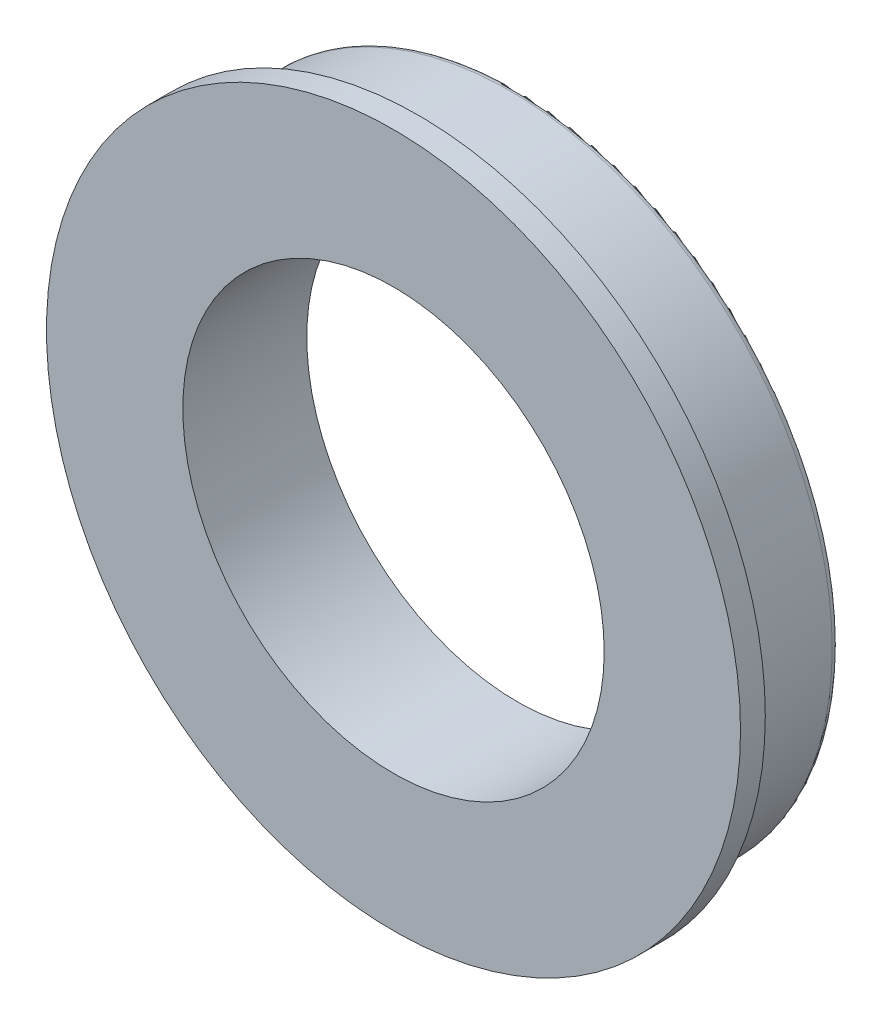
ISO-10303-21;
HEADER;
FILE_DESCRIPTION(('STEP AP214'),'2;1');
FILE_NAME('part.step','',(''),(''),'','','');
FILE_SCHEMA(('AUTOMOTIVE_DESIGN { 1 0 10303 214 1 1 1 1 }'));
ENDSEC;
DATA;
#1=APPLICATION_CONTEXT('core data for automotive mechanical design processes');
#2=APPLICATION_PROTOCOL_DEFINITION('international standard','automotive_design',2000,#1);
#3=PRODUCT_CONTEXT('',#1,'mechanical');
#4=PRODUCT('Part','Part','',(#3));
#5=PRODUCT_RELATED_PRODUCT_CATEGORY('part','',(#4));
#6=PRODUCT_DEFINITION_FORMATION('','',#4);
#7=PRODUCT_DEFINITION_CONTEXT('part definition',#1,'design');
#8=PRODUCT_DEFINITION('design','',#6,#7);
#9=PRODUCT_DEFINITION_SHAPE('','',#8);
#10=(LENGTH_UNIT() NAMED_UNIT(*) SI_UNIT(.MILLI.,.METRE.));
#11=(NAMED_UNIT(*) PLANE_ANGLE_UNIT() SI_UNIT($,.RADIAN.));
#12=(NAMED_UNIT(*) SI_UNIT($,.STERADIAN.) SOLID_ANGLE_UNIT());
#13=UNCERTAINTY_MEASURE_WITH_UNIT(LENGTH_MEASURE(1.E-05),#10,'distance_accuracy_value','');
#14=(GEOMETRIC_REPRESENTATION_CONTEXT(3) GLOBAL_UNCERTAINTY_ASSIGNED_CONTEXT((#13)) GLOBAL_UNIT_ASSIGNED_CONTEXT((#10,
#11,#12)) REPRESENTATION_CONTEXT('',''));
#15=CARTESIAN_POINT('',(0.,0.,0.));
#16=DIRECTION('',(0.,0.,1.));
#17=DIRECTION('',(1.,0.,0.));
#18=AXIS2_PLACEMENT_3D('',#15,#16,#17);
#19=CARTESIAN_POINT('',(0.,0.,5.));
#20=DIRECTION('',(0.,0.,-1.));
#21=DIRECTION('',(-1.,0.,0.));
#22=AXIS2_PLACEMENT_3D('',#19,#20,#21);
#23=CYLINDRICAL_SURFACE('',#22,13.);
#24=CARTESIAN_POINT('',(0.,0.,0.3));
#25=DIRECTION('',(0.,0.,1.));
#26=DIRECTION('',(1.,0.,0.));
#27=AXIS2_PLACEMENT_3D('',#24,#25,#26);
#28=CIRCLE('',#27,13.);
#29=CARTESIAN_POINT('',(13.,0.,0.3));
#30=VERTEX_POINT('',#29);
#31=EDGE_CURVE('E39',#30,#30,#28,.T.);
#32=ORIENTED_EDGE('',*,*,#31,.T.);
#33=EDGE_LOOP('',(#32));
#34=FACE_BOUND('',#33,.T.);
#35=CARTESIAN_POINT('',(0.,0.,4.));
#36=DIRECTION('',(0.,0.,1.));
#37=DIRECTION('',(1.,0.,0.));
#38=AXIS2_PLACEMENT_3D('',#35,#36,#37);
#39=CIRCLE('',#38,13.);
#40=CARTESIAN_POINT('',(13.,0.,4.));
#41=VERTEX_POINT('',#40);
#42=EDGE_CURVE('E43',#41,#41,#39,.T.);
#43=ORIENTED_EDGE('',*,*,#42,.F.);
#44=EDGE_LOOP('',(#43));
#45=FACE_BOUND('',#44,.T.);
#46=ADVANCED_FACE('F32',(#34,#45),#23,.T.);
#47=CARTESIAN_POINT('',(0.,0.,5.));
#48=DIRECTION('',(0.,0.,1.));
#49=DIRECTION('',(1.,0.,0.));
#50=AXIS2_PLACEMENT_3D('',#47,#48,#49);
#51=PLANE('',#50);
#52=CARTESIAN_POINT('',(0.,0.,5.));
#53=DIRECTION('',(0.,0.,1.));
#54=DIRECTION('',(1.,0.,0.));
#55=AXIS2_PLACEMENT_3D('',#52,#53,#54);
#56=CIRCLE('',#55,8.5);
#57=CARTESIAN_POINT('',(8.5,0.,5.));
#58=VERTEX_POINT('',#57);
#59=EDGE_CURVE('E47',#58,#58,#56,.T.);
#60=ORIENTED_EDGE('',*,*,#59,.F.);
#61=EDGE_LOOP('',(#60));
#62=FACE_BOUND('',#61,.T.);
#63=CARTESIAN_POINT('',(0.,0.,5.));
#64=DIRECTION('',(0.,0.,1.));
#65=DIRECTION('',(1.,0.,0.));
#66=AXIS2_PLACEMENT_3D('',#63,#64,#65);
#67=CIRCLE('',#66,14.);
#68=CARTESIAN_POINT('',(14.,0.,5.));
#69=VERTEX_POINT('',#68);
#70=EDGE_CURVE('E56',#69,#69,#67,.T.);
#71=ORIENTED_EDGE('',*,*,#70,.T.);
#72=EDGE_LOOP('',(#71));
#73=FACE_BOUND('',#72,.T.);
#74=ADVANCED_FACE('F77',(#62,#73),#51,.T.);
#75=CARTESIAN_POINT('',(0.,0.,0.));
#76=DIRECTION('',(0.,0.,1.));
#77=DIRECTION('',(1.,0.,0.));
#78=AXIS2_PLACEMENT_3D('',#75,#76,#77);
#79=PLANE('',#78);
#80=CARTESIAN_POINT('',(0.,0.,0.));
#81=DIRECTION('',(0.,0.,1.));
#82=DIRECTION('',(1.,0.,0.));
#83=AXIS2_PLACEMENT_3D('',#80,#81,#82);
#84=CIRCLE('',#83,12.7);
#85=CARTESIAN_POINT('',(12.7,0.,0.));
#86=VERTEX_POINT('',#85);
#87=EDGE_CURVE('E10',#86,#86,#84,.F.);
#88=ORIENTED_EDGE('',*,*,#87,.T.);
#89=EDGE_LOOP('',(#88));
#90=FACE_BOUND('',#89,.T.);
#91=CARTESIAN_POINT('',(0.,0.,0.));
#92=DIRECTION('',(0.,0.,1.));
#93=DIRECTION('',(1.,0.,0.));
#94=AXIS2_PLACEMENT_3D('',#91,#92,#93);
#95=CIRCLE('',#94,8.5);
#96=CARTESIAN_POINT('',(8.5,0.,0.));
#97=VERTEX_POINT('',#96);
#98=EDGE_CURVE('E50',#97,#97,#95,.T.);
#99=ORIENTED_EDGE('',*,*,#98,.T.);
#100=EDGE_LOOP('',(#99));
#101=FACE_BOUND('',#100,.T.);
#102=ADVANCED_FACE('F81',(#90,#101),#79,.F.);
#103=CARTESIAN_POINT('',(0.,0.,5.));
#104=DIRECTION('',(0.,0.,-1.));
#105=DIRECTION('',(-1.,0.,0.));
#106=AXIS2_PLACEMENT_3D('',#103,#104,#105);
#107=CYLINDRICAL_SURFACE('',#106,8.5);
#108=ORIENTED_EDGE('',*,*,#59,.T.);
#109=EDGE_LOOP('',(#108));
#110=FACE_BOUND('',#109,.T.);
#111=ORIENTED_EDGE('',*,*,#98,.F.);
#112=EDGE_LOOP('',(#111));
#113=FACE_BOUND('',#112,.T.);
#114=ADVANCED_FACE('F74',(#110,#113),#107,.F.);
#115=CARTESIAN_POINT('',(0.,0.,4.));
#116=DIRECTION('',(0.,0.,1.));
#117=DIRECTION('',(1.,0.,0.));
#118=AXIS2_PLACEMENT_3D('',#115,#116,#117);
#119=CYLINDRICAL_SURFACE('',#118,14.);
#120=CARTESIAN_POINT('',(0.,0.,4.));
#121=DIRECTION('',(0.,0.,1.));
#122=DIRECTION('',(1.,0.,0.));
#123=AXIS2_PLACEMENT_3D('',#120,#121,#122);
#124=CIRCLE('',#123,14.);
#125=CARTESIAN_POINT('',(14.,0.,4.));
#126=VERTEX_POINT('',#125);
#127=EDGE_CURVE('E53',#126,#126,#124,.T.);
#128=ORIENTED_EDGE('',*,*,#127,.T.);
#129=EDGE_LOOP('',(#128));
#130=FACE_BOUND('',#129,.T.);
#131=ORIENTED_EDGE('',*,*,#70,.F.);
#132=EDGE_LOOP('',(#131));
#133=FACE_BOUND('',#132,.T.);
#134=ADVANCED_FACE('F62',(#130,#133),#119,.T.);
#135=CARTESIAN_POINT('',(0.,0.,4.));
#136=DIRECTION('',(0.,0.,1.));
#137=DIRECTION('',(1.,0.,0.));
#138=AXIS2_PLACEMENT_3D('',#135,#136,#137);
#139=PLANE('',#138);
#140=ORIENTED_EDGE('',*,*,#42,.T.);
#141=EDGE_LOOP('',(#140));
#142=FACE_BOUND('',#141,.T.);
#143=ORIENTED_EDGE('',*,*,#127,.F.);
#144=EDGE_LOOP('',(#143));
#145=FACE_BOUND('',#144,.T.);
#146=ADVANCED_FACE('F65',(#142,#145),#139,.F.);
#147=CARTESIAN_POINT('',(0.,0.,0.3));
#148=DIRECTION('',(0.,0.,1.));
#149=DIRECTION('',(1.,0.,0.));
#150=AXIS2_PLACEMENT_3D('',#147,#148,#149);
#151=TOROIDAL_SURFACE('',#150,12.7,0.3);
#152=ORIENTED_EDGE('',*,*,#87,.F.);
#153=EDGE_LOOP('',(#152));
#154=FACE_BOUND('',#153,.T.);
#155=ORIENTED_EDGE('',*,*,#31,.F.);
#156=EDGE_LOOP('',(#155));
#157=FACE_BOUND('',#156,.T.);
#158=ADVANCED_FACE('F34',(#154,#157),#151,.T.);
#159=CLOSED_SHELL('',(#46,#74,#102,#114,#134,#146,#158));
#160=MANIFOLD_SOLID_BREP('B2',#159);
#161=ADVANCED_BREP_SHAPE_REPRESENTATION('',(#18,#160),#14);
#162=SHAPE_DEFINITION_REPRESENTATION(#9,#161);
ENDSEC;
END-ISO-10303-21;
